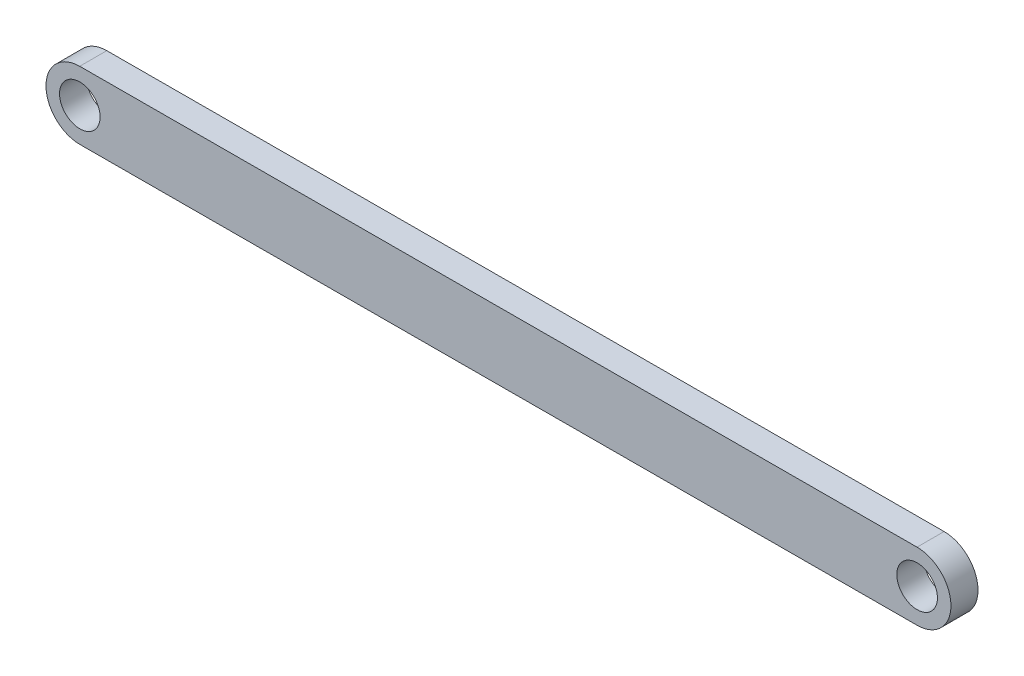
ISO-10303-21;
HEADER;
FILE_DESCRIPTION(('STEP AP214'),'2;1');
FILE_NAME('part.step','',(''),(''),'','','');
FILE_SCHEMA(('AUTOMOTIVE_DESIGN { 1 0 10303 214 1 1 1 1 }'));
ENDSEC;
DATA;
#1=APPLICATION_CONTEXT('core data for automotive mechanical design processes');
#2=APPLICATION_PROTOCOL_DEFINITION('international standard','automotive_design',2000,#1);
#3=PRODUCT_CONTEXT('',#1,'mechanical');
#4=PRODUCT('Part','Part','',(#3));
#5=PRODUCT_RELATED_PRODUCT_CATEGORY('part','',(#4));
#6=PRODUCT_DEFINITION_FORMATION('','',#4);
#7=PRODUCT_DEFINITION_CONTEXT('part definition',#1,'design');
#8=PRODUCT_DEFINITION('design','',#6,#7);
#9=PRODUCT_DEFINITION_SHAPE('','',#8);
#10=(LENGTH_UNIT() NAMED_UNIT(*) SI_UNIT(.MILLI.,.METRE.));
#11=(NAMED_UNIT(*) PLANE_ANGLE_UNIT() SI_UNIT($,.RADIAN.));
#12=(NAMED_UNIT(*) SI_UNIT($,.STERADIAN.) SOLID_ANGLE_UNIT());
#13=UNCERTAINTY_MEASURE_WITH_UNIT(LENGTH_MEASURE(1.E-05),#10,'distance_accuracy_value','');
#14=(GEOMETRIC_REPRESENTATION_CONTEXT(3) GLOBAL_UNCERTAINTY_ASSIGNED_CONTEXT((#13)) GLOBAL_UNIT_ASSIGNED_CONTEXT((#10,
#11,#12)) REPRESENTATION_CONTEXT('',''));
#15=CARTESIAN_POINT('',(0.,0.,0.));
#16=DIRECTION('',(0.,0.,1.));
#17=DIRECTION('',(1.,0.,0.));
#18=AXIS2_PLACEMENT_3D('',#15,#16,#17);
#19=CARTESIAN_POINT('',(-31.0634469830888,-0.172789084715136,2.));
#20=DIRECTION('',(0.,0.,1.));
#21=DIRECTION('',(1.,0.,0.));
#22=AXIS2_PLACEMENT_3D('',#19,#20,#21);
#23=PLANE('',#22);
#24=CARTESIAN_POINT('',(-31.0634469830888,-0.172789084715136,2.));
#25=DIRECTION('',(0.,0.,1.));
#26=DIRECTION('',(1.,0.,0.));
#27=AXIS2_PLACEMENT_3D('',#24,#25,#26);
#28=CIRCLE('',#27,1.5);
#29=CARTESIAN_POINT('',(-29.5634469830888,-0.172789084715136,2.));
#30=VERTEX_POINT('',#29);
#31=EDGE_CURVE('E97',#30,#30,#28,.T.);
#32=ORIENTED_EDGE('',*,*,#31,.F.);
#33=EDGE_LOOP('',(#32));
#34=FACE_BOUND('',#33,.T.);
#35=CARTESIAN_POINT('',(-31.0634469830888,-0.172789084715136,2.));
#36=DIRECTION('',(0.,0.,1.));
#37=DIRECTION('',(1.,0.,0.));
#38=AXIS2_PLACEMENT_3D('',#35,#36,#37);
#39=CIRCLE('',#38,2.5);
#40=CARTESIAN_POINT('',(-31.0700552985228,2.32720218130303,2.));
#41=VERTEX_POINT('',#40);
#42=CARTESIAN_POINT('',(-31.0568386676548,-2.6727803507333,2.));
#43=VERTEX_POINT('',#42);
#44=EDGE_CURVE('E82',#41,#43,#39,.T.);
#45=ORIENTED_EDGE('',*,*,#44,.T.);
#46=DIRECTION('',(0.999996506407267,0.00264332617360133,0.));
#47=VECTOR('',#46,1.);
#48=CARTESIAN_POINT('',(-31.0568386676548,-2.6727803507333,2.));
#49=LINE('',#48,#47);
#50=CARTESIAN_POINT('',(30.8431613323452,-2.50915788895714,2.));
#51=VERTEX_POINT('',#50);
#52=EDGE_CURVE('E77',#43,#51,#49,.T.);
#53=ORIENTED_EDGE('',*,*,#52,.T.);
#54=CARTESIAN_POINT('',(30.8365530169112,-0.00916662293896984,2.));
#55=DIRECTION('',(0.,0.,1.));
#56=DIRECTION('',(1.,0.,0.));
#57=AXIS2_PLACEMENT_3D('',#54,#55,#56);
#58=CIRCLE('',#57,2.5);
#59=CARTESIAN_POINT('',(30.8299447014772,2.4908246430792,2.));
#60=VERTEX_POINT('',#59);
#61=EDGE_CURVE('E80',#51,#60,#58,.T.);
#62=ORIENTED_EDGE('',*,*,#61,.T.);
#63=DIRECTION('',(-0.999996506407267,-0.00264332617360134,0.));
#64=VECTOR('',#63,1.);
#65=CARTESIAN_POINT('',(-31.0700552985228,2.32720218130303,2.));
#66=LINE('',#65,#64);
#67=EDGE_CURVE('E47',#60,#41,#66,.T.);
#68=ORIENTED_EDGE('',*,*,#67,.T.);
#69=EDGE_LOOP('',(#45,#53,#62,#68));
#70=FACE_BOUND('',#69,.T.);
#71=CARTESIAN_POINT('',(30.8365530169112,-0.00916662293896984,2.));
#72=DIRECTION('',(0.,0.,1.));
#73=DIRECTION('',(1.,0.,0.));
#74=AXIS2_PLACEMENT_3D('',#71,#72,#73);
#75=CIRCLE('',#74,1.50000000000002);
#76=CARTESIAN_POINT('',(32.3365530169112,-0.00916662293896984,2.));
#77=VERTEX_POINT('',#76);
#78=EDGE_CURVE('E112',#77,#77,#75,.T.);
#79=ORIENTED_EDGE('',*,*,#78,.F.);
#80=EDGE_LOOP('',(#79));
#81=FACE_BOUND('',#80,.T.);
#82=ADVANCED_FACE('F30',(#34,#70,#81),#23,.T.);
#83=CARTESIAN_POINT('',(-31.0634469830888,-0.172789084715136,0.));
#84=DIRECTION('',(0.,0.,1.));
#85=DIRECTION('',(1.,0.,0.));
#86=AXIS2_PLACEMENT_3D('',#83,#84,#85);
#87=PLANE('',#86);
#88=CARTESIAN_POINT('',(-31.0634469830888,-0.172789084715136,0.));
#89=DIRECTION('',(0.,0.,1.));
#90=DIRECTION('',(1.,0.,0.));
#91=AXIS2_PLACEMENT_3D('',#88,#89,#90);
#92=CIRCLE('',#91,2.5);
#93=CARTESIAN_POINT('',(-31.0700552985228,2.32720218130303,0.));
#94=VERTEX_POINT('',#93);
#95=CARTESIAN_POINT('',(-31.0568386676548,-2.6727803507333,0.));
#96=VERTEX_POINT('',#95);
#97=EDGE_CURVE('E94',#94,#96,#92,.T.);
#98=ORIENTED_EDGE('',*,*,#97,.F.);
#99=DIRECTION('',(-0.999996506407267,-0.00264332617360134,0.));
#100=VECTOR('',#99,1.);
#101=CARTESIAN_POINT('',(-31.0700552985228,2.32720218130303,0.));
#102=LINE('',#101,#100);
#103=CARTESIAN_POINT('',(30.8299447014772,2.4908246430792,0.));
#104=VERTEX_POINT('',#103);
#105=EDGE_CURVE('E70',#104,#94,#102,.T.);
#106=ORIENTED_EDGE('',*,*,#105,.F.);
#107=CARTESIAN_POINT('',(30.8365530169112,-0.00916662293896984,0.));
#108=DIRECTION('',(0.,0.,1.));
#109=DIRECTION('',(1.,0.,0.));
#110=AXIS2_PLACEMENT_3D('',#107,#108,#109);
#111=CIRCLE('',#110,2.5);
#112=CARTESIAN_POINT('',(30.8431613323452,-2.50915788895714,0.));
#113=VERTEX_POINT('',#112);
#114=EDGE_CURVE('E64',#113,#104,#111,.T.);
#115=ORIENTED_EDGE('',*,*,#114,.F.);
#116=DIRECTION('',(0.999996506407267,0.00264332617360133,0.));
#117=VECTOR('',#116,1.);
#118=CARTESIAN_POINT('',(-31.0568386676548,-2.6727803507333,0.));
#119=LINE('',#118,#117);
#120=EDGE_CURVE('E86',#96,#113,#119,.T.);
#121=ORIENTED_EDGE('',*,*,#120,.F.);
#122=EDGE_LOOP('',(#98,#106,#115,#121));
#123=FACE_BOUND('',#122,.T.);
#124=CARTESIAN_POINT('',(-31.0634469830888,-0.172789084715136,0.));
#125=DIRECTION('',(0.,0.,1.));
#126=DIRECTION('',(1.,0.,0.));
#127=AXIS2_PLACEMENT_3D('',#124,#125,#126);
#128=CIRCLE('',#127,1.5);
#129=CARTESIAN_POINT('',(-29.5634469830888,-0.172789084715136,0.));
#130=VERTEX_POINT('',#129);
#131=EDGE_CURVE('E109',#130,#130,#128,.T.);
#132=ORIENTED_EDGE('',*,*,#131,.T.);
#133=EDGE_LOOP('',(#132));
#134=FACE_BOUND('',#133,.T.);
#135=CARTESIAN_POINT('',(30.8365530169112,-0.00916662293896984,0.));
#136=DIRECTION('',(0.,0.,1.));
#137=DIRECTION('',(1.,0.,0.));
#138=AXIS2_PLACEMENT_3D('',#135,#136,#137);
#139=CIRCLE('',#138,1.50000000000002);
#140=CARTESIAN_POINT('',(32.3365530169112,-0.00916662293896984,0.));
#141=VERTEX_POINT('',#140);
#142=EDGE_CURVE('E115',#141,#141,#139,.T.);
#143=ORIENTED_EDGE('',*,*,#142,.T.);
#144=EDGE_LOOP('',(#143));
#145=FACE_BOUND('',#144,.T.);
#146=ADVANCED_FACE('F105',(#123,#134,#145),#87,.F.);
#147=CARTESIAN_POINT('',(-31.0634469830888,-0.172789084715136,2.));
#148=DIRECTION('',(0.,0.,-1.));
#149=DIRECTION('',(-1.,0.,0.));
#150=AXIS2_PLACEMENT_3D('',#147,#148,#149);
#151=CYLINDRICAL_SURFACE('',#150,2.5);
#152=ORIENTED_EDGE('',*,*,#97,.T.);
#153=DIRECTION('',(0.,0.,-1.));
#154=VECTOR('',#153,1.);
#155=CARTESIAN_POINT('',(-31.0568386676548,-2.6727803507333,2.));
#156=LINE('',#155,#154);
#157=EDGE_CURVE('E11',#43,#96,#156,.T.);
#158=ORIENTED_EDGE('',*,*,#157,.F.);
#159=ORIENTED_EDGE('',*,*,#44,.F.);
#160=DIRECTION('',(0.,0.,-1.));
#161=VECTOR('',#160,1.);
#162=CARTESIAN_POINT('',(-31.0700552985228,2.32720218130303,2.));
#163=LINE('',#162,#161);
#164=EDGE_CURVE('E90',#41,#94,#163,.T.);
#165=ORIENTED_EDGE('',*,*,#164,.T.);
#166=EDGE_LOOP('',(#152,#158,#159,#165));
#167=FACE_BOUND('',#166,.T.);
#168=ADVANCED_FACE('F32',(#167),#151,.T.);
#169=CARTESIAN_POINT('',(-31.0568386676548,-2.6727803507333,2.));
#170=DIRECTION('',(-0.00264332617360133,0.999996506407267,0.));
#171=DIRECTION('',(-0.999996506407267,-0.00264332617360133,0.));
#172=AXIS2_PLACEMENT_3D('',#169,#170,#171);
#173=PLANE('',#172);
#174=ORIENTED_EDGE('',*,*,#120,.T.);
#175=DIRECTION('',(0.,0.,-1.));
#176=VECTOR('',#175,1.);
#177=CARTESIAN_POINT('',(30.8431613323452,-2.50915788895714,2.));
#178=LINE('',#177,#176);
#179=EDGE_CURVE('E39',#51,#113,#178,.T.);
#180=ORIENTED_EDGE('',*,*,#179,.F.);
#181=ORIENTED_EDGE('',*,*,#52,.F.);
#182=ORIENTED_EDGE('',*,*,#157,.T.);
#183=EDGE_LOOP('',(#174,#180,#181,#182));
#184=FACE_BOUND('',#183,.T.);
#185=ADVANCED_FACE('F85',(#184),#173,.F.);
#186=CARTESIAN_POINT('',(30.8365530169112,-0.00916662293896984,2.));
#187=DIRECTION('',(0.,0.,-1.));
#188=DIRECTION('',(-1.,0.,0.));
#189=AXIS2_PLACEMENT_3D('',#186,#187,#188);
#190=CYLINDRICAL_SURFACE('',#189,2.5);
#191=ORIENTED_EDGE('',*,*,#114,.T.);
#192=DIRECTION('',(0.,0.,-1.));
#193=VECTOR('',#192,1.);
#194=CARTESIAN_POINT('',(30.8299447014772,2.4908246430792,2.));
#195=LINE('',#194,#193);
#196=EDGE_CURVE('E87',#60,#104,#195,.T.);
#197=ORIENTED_EDGE('',*,*,#196,.F.);
#198=ORIENTED_EDGE('',*,*,#61,.F.);
#199=ORIENTED_EDGE('',*,*,#179,.T.);
#200=EDGE_LOOP('',(#191,#197,#198,#199));
#201=FACE_BOUND('',#200,.T.);
#202=ADVANCED_FACE('F88',(#201),#190,.T.);
#203=CARTESIAN_POINT('',(-31.0700552985228,2.32720218130303,2.));
#204=DIRECTION('',(0.00264332617360134,-0.999996506407267,0.));
#205=DIRECTION('',(0.999996506407267,0.00264332617360134,0.));
#206=AXIS2_PLACEMENT_3D('',#203,#204,#205);
#207=PLANE('',#206);
#208=ORIENTED_EDGE('',*,*,#105,.T.);
#209=ORIENTED_EDGE('',*,*,#164,.F.);
#210=ORIENTED_EDGE('',*,*,#67,.F.);
#211=ORIENTED_EDGE('',*,*,#196,.T.);
#212=EDGE_LOOP('',(#208,#209,#210,#211));
#213=FACE_BOUND('',#212,.T.);
#214=ADVANCED_FACE('F102',(#213),#207,.F.);
#215=CARTESIAN_POINT('',(-31.0634469830888,-0.172789084715136,2.));
#216=DIRECTION('',(0.,0.,-1.));
#217=DIRECTION('',(-1.,0.,0.));
#218=AXIS2_PLACEMENT_3D('',#215,#216,#217);
#219=CYLINDRICAL_SURFACE('',#218,1.5);
#220=ORIENTED_EDGE('',*,*,#31,.T.);
#221=EDGE_LOOP('',(#220));
#222=FACE_BOUND('',#221,.T.);
#223=ORIENTED_EDGE('',*,*,#131,.F.);
#224=EDGE_LOOP('',(#223));
#225=FACE_BOUND('',#224,.T.);
#226=ADVANCED_FACE('F132',(#222,#225),#219,.F.);
#227=CARTESIAN_POINT('',(30.8365530169112,-0.00916662293896984,2.));
#228=DIRECTION('',(0.,0.,-1.));
#229=DIRECTION('',(-1.,0.,0.));
#230=AXIS2_PLACEMENT_3D('',#227,#228,#229);
#231=CYLINDRICAL_SURFACE('',#230,1.50000000000002);
#232=ORIENTED_EDGE('',*,*,#78,.T.);
#233=EDGE_LOOP('',(#232));
#234=FACE_BOUND('',#233,.T.);
#235=ORIENTED_EDGE('',*,*,#142,.F.);
#236=EDGE_LOOP('',(#235));
#237=FACE_BOUND('',#236,.T.);
#238=ADVANCED_FACE('F121',(#234,#237),#231,.F.);
#239=CLOSED_SHELL('',(#82,#146,#168,#185,#202,#214,#226,#238));
#240=MANIFOLD_SOLID_BREP('B2',#239);
#241=ADVANCED_BREP_SHAPE_REPRESENTATION('',(#18,#240),#14);
#242=SHAPE_DEFINITION_REPRESENTATION(#9,#241);
ENDSEC;
END-ISO-10303-21;
